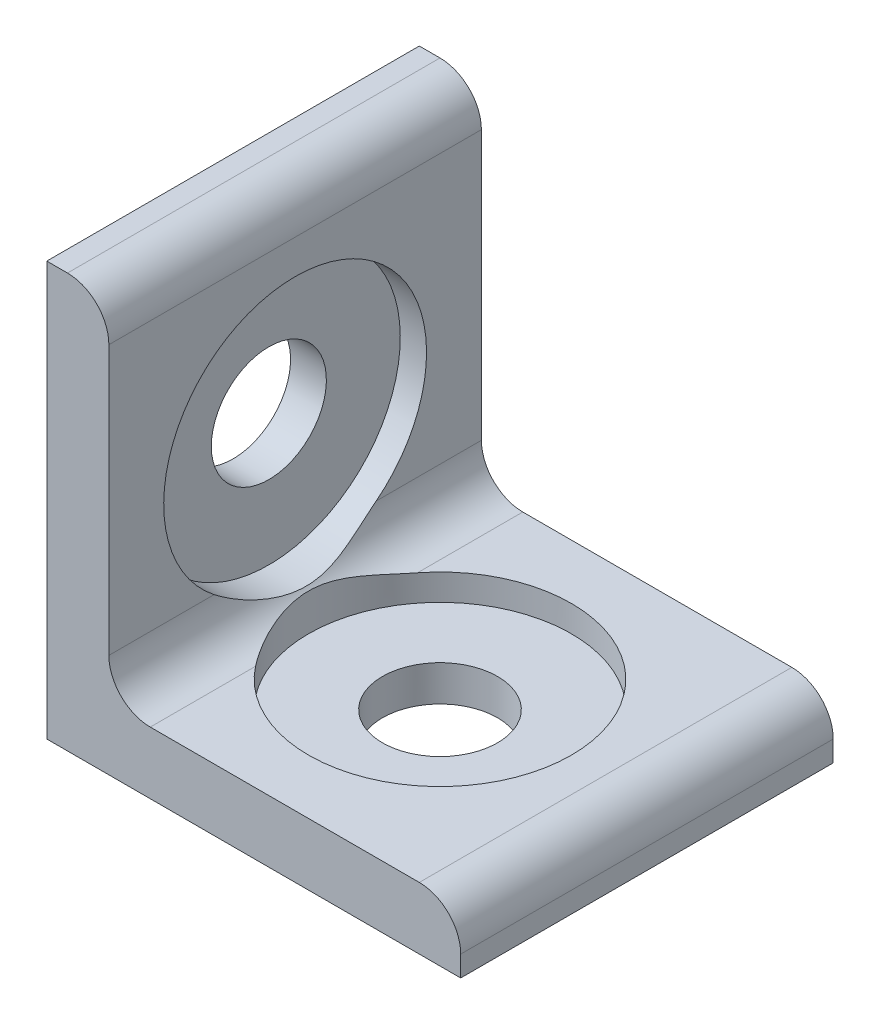
ISO-10303-21;
HEADER;
FILE_DESCRIPTION(('STEP AP214'),'2;1');
FILE_NAME('part.step','',(''),(''),'','','');
FILE_SCHEMA(('AUTOMOTIVE_DESIGN { 1 0 10303 214 1 1 1 1 }'));
ENDSEC;
DATA;
#1=APPLICATION_CONTEXT('core data for automotive mechanical design processes');
#2=APPLICATION_PROTOCOL_DEFINITION('international standard','automotive_design',2000,#1);
#3=PRODUCT_CONTEXT('',#1,'mechanical');
#4=PRODUCT('Part','Part','',(#3));
#5=PRODUCT_RELATED_PRODUCT_CATEGORY('part','',(#4));
#6=PRODUCT_DEFINITION_FORMATION('','',#4);
#7=PRODUCT_DEFINITION_CONTEXT('part definition',#1,'design');
#8=PRODUCT_DEFINITION('design','',#6,#7);
#9=PRODUCT_DEFINITION_SHAPE('','',#8);
#10=(LENGTH_UNIT() NAMED_UNIT(*) SI_UNIT(.MILLI.,.METRE.));
#11=(NAMED_UNIT(*) PLANE_ANGLE_UNIT() SI_UNIT($,.RADIAN.));
#12=(NAMED_UNIT(*) SI_UNIT($,.STERADIAN.) SOLID_ANGLE_UNIT());
#13=UNCERTAINTY_MEASURE_WITH_UNIT(LENGTH_MEASURE(1.E-05),#10,'distance_accuracy_value','');
#14=(GEOMETRIC_REPRESENTATION_CONTEXT(3) GLOBAL_UNCERTAINTY_ASSIGNED_CONTEXT((#13)) GLOBAL_UNIT_ASSIGNED_CONTEXT((#10,
#11,#12)) REPRESENTATION_CONTEXT('',''));
#15=CARTESIAN_POINT('',(0.,0.,0.));
#16=DIRECTION('',(0.,0.,1.));
#17=DIRECTION('',(1.,0.,0.));
#18=AXIS2_PLACEMENT_3D('',#15,#16,#17);
#19=CARTESIAN_POINT('',(5.,5.,9.));
#20=DIRECTION('',(0.,0.,-1.));
#21=DIRECTION('',(-1.,0.,0.));
#22=AXIS2_PLACEMENT_3D('',#19,#20,#21);
#23=CYLINDRICAL_SURFACE('',#22,2.);
#24=CARTESIAN_POINT('',(5.,3.,-3.91439650520997));
#25=CARTESIAN_POINT('',(4.91686534647511,3.00004712388668,-3.80823322344328));
#26=CARTESIAN_POINT('',(4.83723446519502,3.00517692207253,-3.69952480507662));
#27=CARTESIAN_POINT('',(4.68544637756623,3.02340440343871,-3.47792485147918));
#28=CARTESIAN_POINT('',(4.61327540137931,3.03648708799974,-3.36504156522429));
#29=CARTESIAN_POINT('',(4.47667344159784,3.06841253565777,-3.13578789787518));
#30=CARTESIAN_POINT('',(4.41222961999601,3.08724555508076,-3.01942371356788));
#31=CARTESIAN_POINT('',(4.29098526725063,3.12879509300238,-2.78338992446851));
#32=CARTESIAN_POINT('',(4.2341888203949,3.15151367210122,-2.66371859420163));
#33=CARTESIAN_POINT('',(4.12388878178634,3.20100582067212,-2.41129526587899));
#34=CARTESIAN_POINT('',(4.07105672902509,3.22795959415749,-2.27828572762918));
#35=CARTESIAN_POINT('',(3.97449743323953,3.28203446434767,-2.00904732600996));
#36=CARTESIAN_POINT('',(3.93076965559646,3.30915555113121,-1.87281865219714));
#37=CARTESIAN_POINT('',(3.85254452825713,3.36123426263042,-1.59742452119894));
#38=CARTESIAN_POINT('',(3.81804070605221,3.38619339604521,-1.45826119764751));
#39=CARTESIAN_POINT('',(3.75842353239744,3.43159441533537,-1.17721962871129));
#40=CARTESIAN_POINT('',(3.73330791254217,3.45203739192913,-1.03534204787377));
#41=CARTESIAN_POINT('',(3.69340853441653,3.48557592870864,-0.75422918267679));
#42=CARTESIAN_POINT('',(3.6783033075561,3.49889712941343,-0.615067437596728));
#43=CARTESIAN_POINT('',(3.65732240634312,3.51763011869166,-0.33552392835341));
#44=CARTESIAN_POINT('',(3.65144493773303,3.52304344486844,-0.195142406704323));
#45=CARTESIAN_POINT('',(3.64902592582808,3.52525493712405,0.085781935959545));
#46=CARTESIAN_POINT('',(3.65248495394013,3.52205257591057,0.226324766320462));
#47=CARTESIAN_POINT('',(3.66867278838775,3.50745854918763,0.506450103170637));
#48=CARTESIAN_POINT('',(3.6814034054345,3.49606528402685,0.646032416698162));
#49=CARTESIAN_POINT('',(3.71996833344071,3.46302045433145,0.955726652749805));
#50=CARTESIAN_POINT('',(3.7481692155154,3.43959410089635,1.12535224377114));
#51=CARTESIAN_POINT('',(3.81792946384328,3.38611474264766,1.46078347967263));
#52=CARTESIAN_POINT('',(3.8594953762343,3.35605849280733,1.62658720988364));
#53=CARTESIAN_POINT('',(3.95571987323803,3.29331237220814,1.95405807288443));
#54=CARTESIAN_POINT('',(4.01039549711475,3.26061911101506,2.11571951655975));
#55=CARTESIAN_POINT('',(4.13265710750549,3.1965364975859,2.4343132825831));
#56=CARTESIAN_POINT('',(4.20023840841952,3.16514667713623,2.59124729742761));
#57=CARTESIAN_POINT('',(4.32351143888962,3.11714046827508,2.84832591357815));
#58=CARTESIAN_POINT('',(4.37563079935749,3.09909229381931,2.94992491018332));
#59=CARTESIAN_POINT('',(4.48550903802972,3.06645891468779,3.15055001228772));
#60=CARTESIAN_POINT('',(4.54326510649246,3.05187199698951,3.24957736882373));
#61=CARTESIAN_POINT('',(4.66436584247143,3.02739448889013,3.44480611751048));
#62=CARTESIAN_POINT('',(4.72771129027029,3.01750455542635,3.54100711259185));
#63=CARTESIAN_POINT('',(4.85984488343373,3.00381601121665,3.73023856493407));
#64=CARTESIAN_POINT('',(4.92864079398303,3.00002626119659,3.82326421841692));
#65=CARTESIAN_POINT('',(5.,3.,3.91439650520997));
#66=B_SPLINE_CURVE_WITH_KNOTS('',3,(#24,#25,#26,#27,#28,#29,#30,#31,#32,#33,#34,#35,#36,#37,#38,
#39,#40,#41,#42,#43,#44,#45,#46,#47,#48,#49,#50,#51,#52,#53,#54,#55,#56,#57,#58,#59,#60,#61,#62,
#63,#64,#65),.UNSPECIFIED.,.F.,.F.,(4,2,2,2,2,2,2,2,2,2,2,2,2,2,2,2,2,2,2,2,4),(0.,
0.404137244498223,0.807514667221983,1.21021234359896,1.6131242456435,2.04969778328621,
2.48624567734181,2.92248643405346,3.35862171673565,3.77996788873334,4.20123212347293,
4.62252214076881,5.04389445670581,5.5637137584063,6.08378805433221,6.6045420131149,
7.12510726257336,7.4717350742839,7.81819097573685,8.16469531951348,8.51170252003645),.UNSPECIFIED.);
#67=CARTESIAN_POINT('',(5.,3.,-3.91439650520997));
#68=VERTEX_POINT('',#67);
#69=CARTESIAN_POINT('',(5.,3.,3.91439650520997));
#70=VERTEX_POINT('',#69);
#71=EDGE_CURVE('E54',#68,#70,#66,.T.);
#72=ORIENTED_EDGE('',*,*,#71,.F.);
#73=DIRECTION('',(0.,0.,-1.));
#74=VECTOR('',#73,1.);
#75=CARTESIAN_POINT('',(5.,3.,9.));
#76=LINE('',#75,#74);
#77=CARTESIAN_POINT('',(5.,3.,-9.));
#78=VERTEX_POINT('',#77);
#79=EDGE_CURVE('E127',#68,#78,#76,.T.);
#80=ORIENTED_EDGE('',*,*,#79,.T.);
#81=CARTESIAN_POINT('',(5.,5.,-9.));
#82=DIRECTION('',(0.,0.,-1.));
#83=DIRECTION('',(-1.,0.,0.));
#84=AXIS2_PLACEMENT_3D('',#81,#82,#83);
#85=CIRCLE('',#84,2.);
#86=CARTESIAN_POINT('',(3.,5.,-9.));
#87=VERTEX_POINT('',#86);
#88=EDGE_CURVE('E239',#78,#87,#85,.T.);
#89=ORIENTED_EDGE('',*,*,#88,.T.);
#90=DIRECTION('',(0.,0.,-1.));
#91=VECTOR('',#90,1.);
#92=CARTESIAN_POINT('',(3.,5.,9.));
#93=LINE('',#92,#91);
#94=CARTESIAN_POINT('',(3.,5.,-3.91439650520996));
#95=VERTEX_POINT('',#94);
#96=EDGE_CURVE('E143',#95,#87,#93,.T.);
#97=ORIENTED_EDGE('',*,*,#96,.F.);
#98=CARTESIAN_POINT('',(3.,5.,3.91439650520996));
#99=CARTESIAN_POINT('',(3.00004712388669,4.91686534647511,3.80823322344327));
#100=CARTESIAN_POINT('',(3.00517692207253,4.83723446519502,3.6995248050766));
#101=CARTESIAN_POINT('',(3.02340440343871,4.68544637756622,3.47792485147916));
#102=CARTESIAN_POINT('',(3.03648708799975,4.6132754013793,3.36504156522427));
#103=CARTESIAN_POINT('',(3.06841253565778,4.47667344159784,3.13578789787516));
#104=CARTESIAN_POINT('',(3.08724555508076,4.41222961999601,3.01942371356786));
#105=CARTESIAN_POINT('',(3.12879509300238,4.29098526725063,2.7833899244685));
#106=CARTESIAN_POINT('',(3.15151367210122,4.2341888203949,2.66371859420162));
#107=CARTESIAN_POINT('',(3.20100582067213,4.12388878178633,2.41129526587897));
#108=CARTESIAN_POINT('',(3.2279595941575,4.07105672902508,2.27828572762916));
#109=CARTESIAN_POINT('',(3.28203446434768,3.97449743323952,2.00904732600994));
#110=CARTESIAN_POINT('',(3.30915555113121,3.93076965559646,1.87281865219712));
#111=CARTESIAN_POINT('',(3.36123426263043,3.85254452825712,1.59742452119892));
#112=CARTESIAN_POINT('',(3.38619339604521,3.81804070605221,1.45826119764749));
#113=CARTESIAN_POINT('',(3.43159441533538,3.75842353239744,1.17721962871126));
#114=CARTESIAN_POINT('',(3.45203739192913,3.73330791254217,1.03534204787375));
#115=CARTESIAN_POINT('',(3.48557592870864,3.69340853441653,0.754229182676764));
#116=CARTESIAN_POINT('',(3.49889712941343,3.6783033075561,0.615067437596701));
#117=CARTESIAN_POINT('',(3.51763011869166,3.65732240634312,0.335523928353383));
#118=CARTESIAN_POINT('',(3.52304344486844,3.65144493773303,0.195142406704295));
#119=CARTESIAN_POINT('',(3.52525493712405,3.64902592582808,-0.0857819359595742));
#120=CARTESIAN_POINT('',(3.52205257591057,3.65248495394013,-0.226324766320492));
#121=CARTESIAN_POINT('',(3.50745854918763,3.66867278838775,-0.506450103170668));
#122=CARTESIAN_POINT('',(3.49606528402685,3.6814034054345,-0.646032416698193));
#123=CARTESIAN_POINT('',(3.46302045433145,3.71996833344072,-0.955726652749837));
#124=CARTESIAN_POINT('',(3.43959410089635,3.74816921551541,-1.12535224377118));
#125=CARTESIAN_POINT('',(3.38611474264765,3.81792946384329,-1.46078347967266));
#126=CARTESIAN_POINT('',(3.35605849280732,3.85949537623431,-1.62658720988368));
#127=CARTESIAN_POINT('',(3.29331237220813,3.95571987323805,-1.95405807288447));
#128=CARTESIAN_POINT('',(3.26061911101505,4.01039549711477,-2.11571951655979));
#129=CARTESIAN_POINT('',(3.1965364975859,4.13265710750551,-2.43431328258314));
#130=CARTESIAN_POINT('',(3.16514667713623,4.20023840841954,-2.59124729742765));
#131=CARTESIAN_POINT('',(3.11714046827508,4.32351143888964,-2.84832591357818));
#132=CARTESIAN_POINT('',(3.0990922938193,4.37563079935751,-2.94992491018335));
#133=CARTESIAN_POINT('',(3.06645891468779,4.48550903802974,-3.15055001228774));
#134=CARTESIAN_POINT('',(3.05187199698951,4.54326510649248,-3.24957736882374));
#135=CARTESIAN_POINT('',(3.02739448889013,4.66436584247144,-3.44480611751049));
#136=CARTESIAN_POINT('',(3.01750455542635,4.7277112902703,-3.54100711259186));
#137=CARTESIAN_POINT('',(3.00381601121666,4.85984488343373,-3.73023856493407));
#138=CARTESIAN_POINT('',(3.0000262611966,4.92864079398302,-3.82326421841691));
#139=CARTESIAN_POINT('',(3.,5.,-3.91439650520996));
#140=B_SPLINE_CURVE_WITH_KNOTS('',3,(#98,#99,#100,#101,#102,#103,#104,#105,#106,#107,#108,#109,
#110,#111,#112,#113,#114,#115,#116,#117,#118,#119,#120,#121,#122,#123,#124,#125,#126,#127,#128,
#129,#130,#131,#132,#133,#134,#135,#136,#137,#138,#139),.UNSPECIFIED.,.F.,.F.,(4,2,2,2,2,2,2,2,
2,2,2,2,2,2,2,2,2,2,2,2,4),(0.,0.404137244498224,0.807514667221985,1.21021234359896,
1.6131242456435,2.04969778328621,2.48624567734182,2.92248643405347,3.35862171673566,
3.77996788873335,4.20123212347294,4.62252214076882,5.04389445670583,5.56371375840632,
6.08378805433223,6.60454201311492,7.12510726257339,7.47173507428391,7.81819097573685,
8.16469531951347,8.51170252003642),.UNSPECIFIED.);
#141=CARTESIAN_POINT('',(3.,5.,3.91439650520996));
#142=VERTEX_POINT('',#141);
#143=EDGE_CURVE('E61',#142,#95,#140,.T.);
#144=ORIENTED_EDGE('',*,*,#143,.F.);
#145=CARTESIAN_POINT('',(3.,5.,9.));
#146=VERTEX_POINT('',#145);
#147=EDGE_CURVE('E139',#146,#142,#93,.T.);
#148=ORIENTED_EDGE('',*,*,#147,.F.);
#149=CARTESIAN_POINT('',(5.,5.,9.));
#150=DIRECTION('',(0.,0.,-1.));
#151=DIRECTION('',(-1.,0.,0.));
#152=AXIS2_PLACEMENT_3D('',#149,#150,#151);
#153=CIRCLE('',#152,2.);
#154=CARTESIAN_POINT('',(5.,3.,9.));
#155=VERTEX_POINT('',#154);
#156=EDGE_CURVE('E221',#155,#146,#153,.T.);
#157=ORIENTED_EDGE('',*,*,#156,.F.);
#158=EDGE_CURVE('E130',#155,#70,#76,.T.);
#159=ORIENTED_EDGE('',*,*,#158,.T.);
#160=EDGE_LOOP('',(#72,#80,#89,#97,#144,#148,#157,#159));
#161=FACE_BOUND('',#160,.T.);
#162=ADVANCED_FACE('F41',(#161),#23,.F.);
#163=CARTESIAN_POINT('',(10.,20.,0.));
#164=DIRECTION('',(0.,-1.,0.));
#165=DIRECTION('',(0.,0.,-1.));
#166=AXIS2_PLACEMENT_3D('',#163,#164,#165);
#167=CYLINDRICAL_SURFACE('',#166,2.78);
#168=CARTESIAN_POINT('',(10.,0.,0.));
#169=DIRECTION('',(0.,-1.,0.));
#170=DIRECTION('',(0.,0.,-1.));
#171=AXIS2_PLACEMENT_3D('',#168,#169,#170);
#172=CIRCLE('',#171,2.78);
#173=CARTESIAN_POINT('',(10.,0.,-2.78));
#174=VERTEX_POINT('',#173);
#175=EDGE_CURVE('E205',#174,#174,#172,.T.);
#176=ORIENTED_EDGE('',*,*,#175,.T.);
#177=EDGE_LOOP('',(#176));
#178=FACE_BOUND('',#177,.T.);
#179=CARTESIAN_POINT('',(10.,1.73,0.));
#180=DIRECTION('',(0.,1.,0.));
#181=DIRECTION('',(-1.,0.,0.));
#182=AXIS2_PLACEMENT_3D('',#179,#180,#181);
#183=CIRCLE('',#182,2.78);
#184=CARTESIAN_POINT('',(7.22,1.73,0.));
#185=VERTEX_POINT('',#184);
#186=EDGE_CURVE('E132',#185,#185,#183,.F.);
#187=ORIENTED_EDGE('',*,*,#186,.F.);
#188=EDGE_LOOP('',(#187));
#189=FACE_BOUND('',#188,.T.);
#190=ADVANCED_FACE('F297',(#178,#189),#167,.F.);
#191=CARTESIAN_POINT('',(20.,10.,0.));
#192=DIRECTION('',(-1.,0.,0.));
#193=DIRECTION('',(0.,0.,1.));
#194=AXIS2_PLACEMENT_3D('',#191,#192,#193);
#195=CYLINDRICAL_SURFACE('',#194,2.78);
#196=CARTESIAN_POINT('',(0.,10.,0.));
#197=DIRECTION('',(-1.,0.,0.));
#198=DIRECTION('',(0.,0.,1.));
#199=AXIS2_PLACEMENT_3D('',#196,#197,#198);
#200=CIRCLE('',#199,2.78);
#201=CARTESIAN_POINT('',(0.,10.,2.78));
#202=VERTEX_POINT('',#201);
#203=EDGE_CURVE('E202',#202,#202,#200,.T.);
#204=ORIENTED_EDGE('',*,*,#203,.T.);
#205=EDGE_LOOP('',(#204));
#206=FACE_BOUND('',#205,.T.);
#207=CARTESIAN_POINT('',(1.73,10.,0.));
#208=DIRECTION('',(1.,0.,0.));
#209=DIRECTION('',(0.,1.,0.));
#210=AXIS2_PLACEMENT_3D('',#207,#208,#209);
#211=CIRCLE('',#210,2.78);
#212=CARTESIAN_POINT('',(1.73,12.78,0.));
#213=VERTEX_POINT('',#212);
#214=EDGE_CURVE('E157',#213,#213,#211,.F.);
#215=ORIENTED_EDGE('',*,*,#214,.F.);
#216=EDGE_LOOP('',(#215));
#217=FACE_BOUND('',#216,.T.);
#218=ADVANCED_FACE('F195',(#206,#217),#195,.F.);
#219=CARTESIAN_POINT('',(0.,0.,9.));
#220=DIRECTION('',(1.,0.,0.));
#221=DIRECTION('',(0.,0.,-1.));
#222=AXIS2_PLACEMENT_3D('',#219,#220,#221);
#223=PLANE('',#222);
#224=ORIENTED_EDGE('',*,*,#203,.F.);
#225=EDGE_LOOP('',(#224));
#226=FACE_BOUND('',#225,.T.);
#227=DIRECTION('',(0.,-1.,0.));
#228=VECTOR('',#227,1.);
#229=CARTESIAN_POINT('',(0.,0.,-9.));
#230=LINE('',#229,#228);
#231=CARTESIAN_POINT('',(0.,20.,-9.));
#232=VERTEX_POINT('',#231);
#233=CARTESIAN_POINT('',(0.,0.,-9.));
#234=VERTEX_POINT('',#233);
#235=EDGE_CURVE('E208',#232,#234,#230,.T.);
#236=ORIENTED_EDGE('',*,*,#235,.T.);
#237=DIRECTION('',(0.,0.,-1.));
#238=VECTOR('',#237,1.);
#239=CARTESIAN_POINT('',(0.,0.,9.));
#240=LINE('',#239,#238);
#241=CARTESIAN_POINT('',(0.,0.,9.));
#242=VERTEX_POINT('',#241);
#243=EDGE_CURVE('E154',#242,#234,#240,.T.);
#244=ORIENTED_EDGE('',*,*,#243,.F.);
#245=DIRECTION('',(0.,-1.,0.));
#246=VECTOR('',#245,1.);
#247=CARTESIAN_POINT('',(0.,0.,9.));
#248=LINE('',#247,#246);
#249=CARTESIAN_POINT('',(0.,20.,9.));
#250=VERTEX_POINT('',#249);
#251=EDGE_CURVE('E209',#250,#242,#248,.T.);
#252=ORIENTED_EDGE('',*,*,#251,.F.);
#253=DIRECTION('',(0.,0.,-1.));
#254=VECTOR('',#253,1.);
#255=CARTESIAN_POINT('',(0.,20.,9.));
#256=LINE('',#255,#254);
#257=EDGE_CURVE('E229',#250,#232,#256,.T.);
#258=ORIENTED_EDGE('',*,*,#257,.T.);
#259=EDGE_LOOP('',(#236,#244,#252,#258));
#260=FACE_BOUND('',#259,.T.);
#261=ADVANCED_FACE('F43',(#226,#260),#223,.F.);
#262=CARTESIAN_POINT('',(0.,0.,9.));
#263=DIRECTION('',(0.,1.,0.));
#264=DIRECTION('',(0.,0.,1.));
#265=AXIS2_PLACEMENT_3D('',#262,#263,#264);
#266=PLANE('',#265);
#267=ORIENTED_EDGE('',*,*,#175,.F.);
#268=EDGE_LOOP('',(#267));
#269=FACE_BOUND('',#268,.T.);
#270=DIRECTION('',(1.,0.,0.));
#271=VECTOR('',#270,1.);
#272=CARTESIAN_POINT('',(0.,0.,-9.));
#273=LINE('',#272,#271);
#274=CARTESIAN_POINT('',(20.,0.,-9.));
#275=VERTEX_POINT('',#274);
#276=EDGE_CURVE('E232',#234,#275,#273,.T.);
#277=ORIENTED_EDGE('',*,*,#276,.T.);
#278=DIRECTION('',(0.,0.,-1.));
#279=VECTOR('',#278,1.);
#280=CARTESIAN_POINT('',(20.,0.,9.));
#281=LINE('',#280,#279);
#282=CARTESIAN_POINT('',(20.,0.,9.));
#283=VERTEX_POINT('',#282);
#284=EDGE_CURVE('E151',#283,#275,#281,.T.);
#285=ORIENTED_EDGE('',*,*,#284,.F.);
#286=DIRECTION('',(1.,0.,0.));
#287=VECTOR('',#286,1.);
#288=CARTESIAN_POINT('',(0.,0.,9.));
#289=LINE('',#288,#287);
#290=EDGE_CURVE('E212',#242,#283,#289,.T.);
#291=ORIENTED_EDGE('',*,*,#290,.F.);
#292=ORIENTED_EDGE('',*,*,#243,.T.);
#293=EDGE_LOOP('',(#277,#285,#291,#292));
#294=FACE_BOUND('',#293,.T.);
#295=ADVANCED_FACE('F288',(#269,#294),#266,.F.);
#296=CARTESIAN_POINT('',(20.,0.,9.));
#297=DIRECTION('',(-1.,0.,0.));
#298=DIRECTION('',(0.,0.,1.));
#299=AXIS2_PLACEMENT_3D('',#296,#297,#298);
#300=PLANE('',#299);
#301=DIRECTION('',(0.,1.,0.));
#302=VECTOR('',#301,1.);
#303=CARTESIAN_POINT('',(20.,0.,-9.));
#304=LINE('',#303,#302);
#305=CARTESIAN_POINT('',(20.,1.,-9.));
#306=VERTEX_POINT('',#305);
#307=EDGE_CURVE('E234',#275,#306,#304,.T.);
#308=ORIENTED_EDGE('',*,*,#307,.T.);
#309=DIRECTION('',(0.,0.,-1.));
#310=VECTOR('',#309,1.);
#311=CARTESIAN_POINT('',(20.,1.,9.));
#312=LINE('',#311,#310);
#313=CARTESIAN_POINT('',(20.,1.,9.));
#314=VERTEX_POINT('',#313);
#315=EDGE_CURVE('E148',#314,#306,#312,.T.);
#316=ORIENTED_EDGE('',*,*,#315,.F.);
#317=DIRECTION('',(0.,1.,0.));
#318=VECTOR('',#317,1.);
#319=CARTESIAN_POINT('',(20.,0.,9.));
#320=LINE('',#319,#318);
#321=EDGE_CURVE('E215',#283,#314,#320,.T.);
#322=ORIENTED_EDGE('',*,*,#321,.F.);
#323=ORIENTED_EDGE('',*,*,#284,.T.);
#324=EDGE_LOOP('',(#308,#316,#322,#323));
#325=FACE_BOUND('',#324,.T.);
#326=ADVANCED_FACE('F285',(#325),#300,.F.);
#327=CARTESIAN_POINT('',(18.,1.,9.));
#328=DIRECTION('',(0.,0.,-1.));
#329=DIRECTION('',(-1.,0.,0.));
#330=AXIS2_PLACEMENT_3D('',#327,#328,#329);
#331=CYLINDRICAL_SURFACE('',#330,2.);
#332=CARTESIAN_POINT('',(18.,1.,-9.));
#333=DIRECTION('',(0.,0.,1.));
#334=DIRECTION('',(1.,0.,0.));
#335=AXIS2_PLACEMENT_3D('',#332,#333,#334);
#336=CIRCLE('',#335,2.);
#337=CARTESIAN_POINT('',(18.,3.,-9.));
#338=VERTEX_POINT('',#337);
#339=EDGE_CURVE('E236',#306,#338,#336,.T.);
#340=ORIENTED_EDGE('',*,*,#339,.T.);
#341=DIRECTION('',(0.,0.,-1.));
#342=VECTOR('',#341,1.);
#343=CARTESIAN_POINT('',(18.,3.,9.));
#344=LINE('',#343,#342);
#345=CARTESIAN_POINT('',(18.,3.,9.));
#346=VERTEX_POINT('',#345);
#347=EDGE_CURVE('E141',#346,#338,#344,.T.);
#348=ORIENTED_EDGE('',*,*,#347,.F.);
#349=CARTESIAN_POINT('',(18.,1.,9.));
#350=DIRECTION('',(0.,0.,1.));
#351=DIRECTION('',(1.,0.,0.));
#352=AXIS2_PLACEMENT_3D('',#349,#350,#351);
#353=CIRCLE('',#352,2.);
#354=EDGE_CURVE('E217',#314,#346,#353,.T.);
#355=ORIENTED_EDGE('',*,*,#354,.F.);
#356=ORIENTED_EDGE('',*,*,#315,.T.);
#357=EDGE_LOOP('',(#340,#348,#355,#356));
#358=FACE_BOUND('',#357,.T.);
#359=ADVANCED_FACE('F281',(#358),#331,.T.);
#360=CARTESIAN_POINT('',(18.,3.,9.));
#361=DIRECTION('',(0.,-1.,0.));
#362=DIRECTION('',(1.,0.,0.));
#363=AXIS2_PLACEMENT_3D('',#360,#361,#362);
#364=PLANE('',#363);
#365=CARTESIAN_POINT('',(10.,3.,0.));
#366=DIRECTION('',(0.,-1.,0.));
#367=DIRECTION('',(1.,0.,0.));
#368=AXIS2_PLACEMENT_3D('',#365,#366,#367);
#369=CIRCLE('',#368,6.35);
#370=EDGE_CURVE('E11',#70,#68,#369,.F.);
#371=ORIENTED_EDGE('',*,*,#370,.F.);
#372=ORIENTED_EDGE('',*,*,#158,.F.);
#373=DIRECTION('',(-1.,0.,0.));
#374=VECTOR('',#373,1.);
#375=CARTESIAN_POINT('',(18.,3.,9.));
#376=LINE('',#375,#374);
#377=EDGE_CURVE('E219',#346,#155,#376,.T.);
#378=ORIENTED_EDGE('',*,*,#377,.F.);
#379=ORIENTED_EDGE('',*,*,#347,.T.);
#380=DIRECTION('',(-1.,0.,0.));
#381=VECTOR('',#380,1.);
#382=CARTESIAN_POINT('',(18.,3.,-9.));
#383=LINE('',#382,#381);
#384=EDGE_CURVE('E137',#338,#78,#383,.T.);
#385=ORIENTED_EDGE('',*,*,#384,.T.);
#386=ORIENTED_EDGE('',*,*,#79,.F.);
#387=EDGE_LOOP('',(#371,#372,#378,#379,#385,#386));
#388=FACE_BOUND('',#387,.T.);
#389=ADVANCED_FACE('F134',(#388),#364,.F.);
#390=CARTESIAN_POINT('',(3.,18.,9.));
#391=DIRECTION('',(-1.,0.,0.));
#392=DIRECTION('',(0.,-1.,0.));
#393=AXIS2_PLACEMENT_3D('',#390,#391,#392);
#394=PLANE('',#393);
#395=CARTESIAN_POINT('',(3.,10.,0.));
#396=DIRECTION('',(-1.,0.,0.));
#397=DIRECTION('',(0.,-1.,0.));
#398=AXIS2_PLACEMENT_3D('',#395,#396,#397);
#399=CIRCLE('',#398,6.35);
#400=EDGE_CURVE('E49',#95,#142,#399,.F.);
#401=ORIENTED_EDGE('',*,*,#400,.F.);
#402=ORIENTED_EDGE('',*,*,#96,.T.);
#403=DIRECTION('',(0.,1.,0.));
#404=VECTOR('',#403,1.);
#405=CARTESIAN_POINT('',(3.,18.,-9.));
#406=LINE('',#405,#404);
#407=CARTESIAN_POINT('',(3.,18.,-9.));
#408=VERTEX_POINT('',#407);
#409=EDGE_CURVE('E241',#87,#408,#406,.T.);
#410=ORIENTED_EDGE('',*,*,#409,.T.);
#411=DIRECTION('',(0.,0.,-1.));
#412=VECTOR('',#411,1.);
#413=CARTESIAN_POINT('',(3.,18.,9.));
#414=LINE('',#413,#412);
#415=CARTESIAN_POINT('',(3.,18.,9.));
#416=VERTEX_POINT('',#415);
#417=EDGE_CURVE('E250',#416,#408,#414,.T.);
#418=ORIENTED_EDGE('',*,*,#417,.F.);
#419=DIRECTION('',(0.,1.,0.));
#420=VECTOR('',#419,1.);
#421=CARTESIAN_POINT('',(3.,18.,9.));
#422=LINE('',#421,#420);
#423=EDGE_CURVE('E223',#146,#416,#422,.T.);
#424=ORIENTED_EDGE('',*,*,#423,.F.);
#425=ORIENTED_EDGE('',*,*,#147,.T.);
#426=EDGE_LOOP('',(#401,#402,#410,#418,#424,#425));
#427=FACE_BOUND('',#426,.T.);
#428=ADVANCED_FACE('F258',(#427),#394,.F.);
#429=CARTESIAN_POINT('',(1.,18.,9.));
#430=DIRECTION('',(0.,0.,-1.));
#431=DIRECTION('',(-1.,0.,0.));
#432=AXIS2_PLACEMENT_3D('',#429,#430,#431);
#433=CYLINDRICAL_SURFACE('',#432,2.);
#434=CARTESIAN_POINT('',(1.,18.,-9.));
#435=DIRECTION('',(0.,0.,1.));
#436=DIRECTION('',(-1.,0.,0.));
#437=AXIS2_PLACEMENT_3D('',#434,#435,#436);
#438=CIRCLE('',#437,2.);
#439=CARTESIAN_POINT('',(1.,20.,-9.));
#440=VERTEX_POINT('',#439);
#441=EDGE_CURVE('E243',#408,#440,#438,.T.);
#442=ORIENTED_EDGE('',*,*,#441,.T.);
#443=DIRECTION('',(0.,0.,-1.));
#444=VECTOR('',#443,1.);
#445=CARTESIAN_POINT('',(1.,20.,9.));
#446=LINE('',#445,#444);
#447=CARTESIAN_POINT('',(1.,20.,9.));
#448=VERTEX_POINT('',#447);
#449=EDGE_CURVE('E248',#448,#440,#446,.T.);
#450=ORIENTED_EDGE('',*,*,#449,.F.);
#451=CARTESIAN_POINT('',(1.,18.,9.));
#452=DIRECTION('',(0.,0.,1.));
#453=DIRECTION('',(-1.,0.,0.));
#454=AXIS2_PLACEMENT_3D('',#451,#452,#453);
#455=CIRCLE('',#454,2.);
#456=EDGE_CURVE('E225',#416,#448,#455,.T.);
#457=ORIENTED_EDGE('',*,*,#456,.F.);
#458=ORIENTED_EDGE('',*,*,#417,.T.);
#459=EDGE_LOOP('',(#442,#450,#457,#458));
#460=FACE_BOUND('',#459,.T.);
#461=ADVANCED_FACE('F264',(#460),#433,.T.);
#462=CARTESIAN_POINT('',(0.,20.,9.));
#463=DIRECTION('',(0.,-1.,0.));
#464=DIRECTION('',(1.,0.,0.));
#465=AXIS2_PLACEMENT_3D('',#462,#463,#464);
#466=PLANE('',#465);
#467=DIRECTION('',(-1.,0.,0.));
#468=VECTOR('',#467,1.);
#469=CARTESIAN_POINT('',(0.,20.,-9.));
#470=LINE('',#469,#468);
#471=EDGE_CURVE('E213',#440,#232,#470,.T.);
#472=ORIENTED_EDGE('',*,*,#471,.T.);
#473=ORIENTED_EDGE('',*,*,#257,.F.);
#474=DIRECTION('',(-1.,0.,0.));
#475=VECTOR('',#474,1.);
#476=CARTESIAN_POINT('',(0.,20.,9.));
#477=LINE('',#476,#475);
#478=EDGE_CURVE('E227',#448,#250,#477,.T.);
#479=ORIENTED_EDGE('',*,*,#478,.F.);
#480=ORIENTED_EDGE('',*,*,#449,.T.);
#481=EDGE_LOOP('',(#472,#473,#479,#480));
#482=FACE_BOUND('',#481,.T.);
#483=ADVANCED_FACE('F267',(#482),#466,.F.);
#484=CARTESIAN_POINT('',(1.,18.,9.));
#485=DIRECTION('',(0.,0.,-1.));
#486=DIRECTION('',(-1.,0.,0.));
#487=AXIS2_PLACEMENT_3D('',#484,#485,#486);
#488=PLANE('',#487);
#489=ORIENTED_EDGE('',*,*,#251,.T.);
#490=ORIENTED_EDGE('',*,*,#290,.T.);
#491=ORIENTED_EDGE('',*,*,#321,.T.);
#492=ORIENTED_EDGE('',*,*,#354,.T.);
#493=ORIENTED_EDGE('',*,*,#377,.T.);
#494=ORIENTED_EDGE('',*,*,#156,.T.);
#495=ORIENTED_EDGE('',*,*,#423,.T.);
#496=ORIENTED_EDGE('',*,*,#456,.T.);
#497=ORIENTED_EDGE('',*,*,#478,.T.);
#498=EDGE_LOOP('',(#489,#490,#491,#492,#493,#494,#495,#496,#497));
#499=FACE_BOUND('',#498,.T.);
#500=ADVANCED_FACE('F271',(#499),#488,.F.);
#501=CARTESIAN_POINT('',(1.,18.,-9.));
#502=DIRECTION('',(0.,0.,-1.));
#503=DIRECTION('',(-1.,0.,0.));
#504=AXIS2_PLACEMENT_3D('',#501,#502,#503);
#505=PLANE('',#504);
#506=ORIENTED_EDGE('',*,*,#235,.F.);
#507=ORIENTED_EDGE('',*,*,#471,.F.);
#508=ORIENTED_EDGE('',*,*,#441,.F.);
#509=ORIENTED_EDGE('',*,*,#409,.F.);
#510=ORIENTED_EDGE('',*,*,#88,.F.);
#511=ORIENTED_EDGE('',*,*,#384,.F.);
#512=ORIENTED_EDGE('',*,*,#339,.F.);
#513=ORIENTED_EDGE('',*,*,#307,.F.);
#514=ORIENTED_EDGE('',*,*,#276,.F.);
#515=EDGE_LOOP('',(#506,#507,#508,#509,#510,#511,#512,#513,#514));
#516=FACE_BOUND('',#515,.T.);
#517=ADVANCED_FACE('F193',(#516),#505,.T.);
#518=CARTESIAN_POINT('',(20.,10.,0.));
#519=DIRECTION('',(-1.,0.,0.));
#520=DIRECTION('',(0.,-1.,0.));
#521=AXIS2_PLACEMENT_3D('',#518,#519,#520);
#522=CYLINDRICAL_SURFACE('',#521,6.35);
#523=CARTESIAN_POINT('',(1.73,10.,0.));
#524=DIRECTION('',(1.,0.,0.));
#525=DIRECTION('',(0.,1.,0.));
#526=AXIS2_PLACEMENT_3D('',#523,#524,#525);
#527=CIRCLE('',#526,6.35);
#528=CARTESIAN_POINT('',(1.73,16.35,0.));
#529=VERTEX_POINT('',#528);
#530=EDGE_CURVE('E131',#529,#529,#527,.T.);
#531=ORIENTED_EDGE('',*,*,#530,.F.);
#532=EDGE_LOOP('',(#531));
#533=FACE_BOUND('',#532,.T.);
#534=ORIENTED_EDGE('',*,*,#143,.T.);
#535=ORIENTED_EDGE('',*,*,#400,.T.);
#536=EDGE_LOOP('',(#534,#535));
#537=FACE_BOUND('',#536,.T.);
#538=ADVANCED_FACE('F188',(#533,#537),#522,.F.);
#539=CARTESIAN_POINT('',(1.73,10.,0.));
#540=DIRECTION('',(1.,0.,0.));
#541=DIRECTION('',(0.,1.,0.));
#542=AXIS2_PLACEMENT_3D('',#539,#540,#541);
#543=PLANE('',#542);
#544=ORIENTED_EDGE('',*,*,#530,.T.);
#545=EDGE_LOOP('',(#544));
#546=FACE_BOUND('',#545,.T.);
#547=ORIENTED_EDGE('',*,*,#214,.T.);
#548=EDGE_LOOP('',(#547));
#549=FACE_BOUND('',#548,.T.);
#550=ADVANCED_FACE('F184',(#546,#549),#543,.T.);
#551=CARTESIAN_POINT('',(10.,20.,0.));
#552=DIRECTION('',(0.,-1.,0.));
#553=DIRECTION('',(1.,0.,0.));
#554=AXIS2_PLACEMENT_3D('',#551,#552,#553);
#555=CYLINDRICAL_SURFACE('',#554,6.35);
#556=CARTESIAN_POINT('',(10.,1.73,0.));
#557=DIRECTION('',(0.,1.,0.));
#558=DIRECTION('',(-1.,0.,0.));
#559=AXIS2_PLACEMENT_3D('',#556,#557,#558);
#560=CIRCLE('',#559,6.35);
#561=CARTESIAN_POINT('',(3.65,1.73,0.));
#562=VERTEX_POINT('',#561);
#563=EDGE_CURVE('E161',#562,#562,#560,.T.);
#564=ORIENTED_EDGE('',*,*,#563,.F.);
#565=EDGE_LOOP('',(#564));
#566=FACE_BOUND('',#565,.T.);
#567=ORIENTED_EDGE('',*,*,#71,.T.);
#568=ORIENTED_EDGE('',*,*,#370,.T.);
#569=EDGE_LOOP('',(#567,#568));
#570=FACE_BOUND('',#569,.T.);
#571=ADVANCED_FACE('F120',(#566,#570),#555,.F.);
#572=CARTESIAN_POINT('',(10.,1.73,0.));
#573=DIRECTION('',(0.,1.,0.));
#574=DIRECTION('',(-1.,0.,0.));
#575=AXIS2_PLACEMENT_3D('',#572,#573,#574);
#576=PLANE('',#575);
#577=ORIENTED_EDGE('',*,*,#563,.T.);
#578=EDGE_LOOP('',(#577));
#579=FACE_BOUND('',#578,.T.);
#580=ORIENTED_EDGE('',*,*,#186,.T.);
#581=EDGE_LOOP('',(#580));
#582=FACE_BOUND('',#581,.T.);
#583=ADVANCED_FACE('F183',(#579,#582),#576,.T.);
#584=CLOSED_SHELL('',(#162,#190,#218,#261,#295,#326,#359,#389,#428,#461,#483,#500,#517,#538,
#550,#571,#583));
#585=MANIFOLD_SOLID_BREP('B2',#584);
#586=ADVANCED_BREP_SHAPE_REPRESENTATION('',(#18,#585),#14);
#587=SHAPE_DEFINITION_REPRESENTATION(#9,#586);
ENDSEC;
END-ISO-10303-21;
